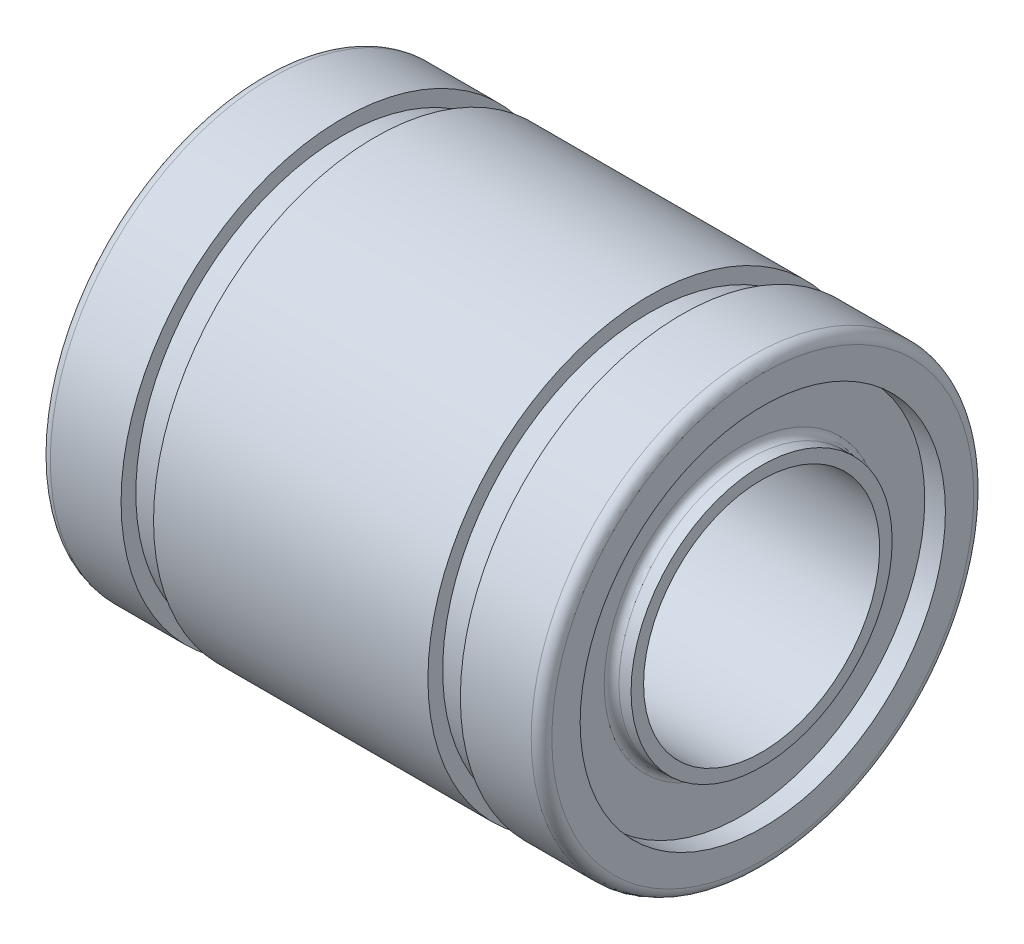
ISO-10303-21;
HEADER;
FILE_DESCRIPTION(('STEP AP214'),'2;1');
FILE_NAME('part.step','',(''),(''),'','','');
FILE_SCHEMA(('AUTOMOTIVE_DESIGN { 1 0 10303 214 1 1 1 1 }'));
ENDSEC;
DATA;
#1=APPLICATION_CONTEXT('core data for automotive mechanical design processes');
#2=APPLICATION_PROTOCOL_DEFINITION('international standard','automotive_design',2000,#1);
#3=PRODUCT_CONTEXT('',#1,'mechanical');
#4=PRODUCT('Part','Part','',(#3));
#5=PRODUCT_RELATED_PRODUCT_CATEGORY('part','',(#4));
#6=PRODUCT_DEFINITION_FORMATION('','',#4);
#7=PRODUCT_DEFINITION_CONTEXT('part definition',#1,'design');
#8=PRODUCT_DEFINITION('design','',#6,#7);
#9=PRODUCT_DEFINITION_SHAPE('','',#8);
#10=(LENGTH_UNIT() NAMED_UNIT(*) SI_UNIT(.MILLI.,.METRE.));
#11=(NAMED_UNIT(*) PLANE_ANGLE_UNIT() SI_UNIT($,.RADIAN.));
#12=(NAMED_UNIT(*) SI_UNIT($,.STERADIAN.) SOLID_ANGLE_UNIT());
#13=UNCERTAINTY_MEASURE_WITH_UNIT(LENGTH_MEASURE(1.E-05),#10,'distance_accuracy_value','');
#14=(GEOMETRIC_REPRESENTATION_CONTEXT(3) GLOBAL_UNCERTAINTY_ASSIGNED_CONTEXT((#13)) GLOBAL_UNIT_ASSIGNED_CONTEXT((#10,
#11,#12)) REPRESENTATION_CONTEXT('',''));
#15=CARTESIAN_POINT('',(0.,0.,0.));
#16=DIRECTION('',(0.,0.,1.));
#17=DIRECTION('',(1.,0.,0.));
#18=AXIS2_PLACEMENT_3D('',#15,#16,#17);
#19=CARTESIAN_POINT('',(0.,0.,0.));
#20=DIRECTION('',(-1.,0.,0.));
#21=DIRECTION('',(0.,0.,1.));
#22=AXIS2_PLACEMENT_3D('',#19,#20,#21);
#23=CYLINDRICAL_SURFACE('',#22,4.);
#24=CARTESIAN_POINT('',(8.46,0.,0.));
#25=DIRECTION('',(-1.,0.,0.));
#26=DIRECTION('',(0.,0.,1.));
#27=AXIS2_PLACEMENT_3D('',#24,#25,#26);
#28=CIRCLE('',#27,4.);
#29=CARTESIAN_POINT('',(8.46,0.,4.));
#30=VERTEX_POINT('',#29);
#31=EDGE_CURVE('E269',#30,#30,#28,.T.);
#32=ORIENTED_EDGE('',*,*,#31,.F.);
#33=EDGE_LOOP('',(#32));
#34=FACE_BOUND('',#33,.T.);
#35=CARTESIAN_POINT('',(-8.46,0.,0.));
#36=DIRECTION('',(-1.,0.,0.));
#37=DIRECTION('',(0.,0.,1.));
#38=AXIS2_PLACEMENT_3D('',#35,#36,#37);
#39=CIRCLE('',#38,4.);
#40=CARTESIAN_POINT('',(-8.46,0.,4.));
#41=VERTEX_POINT('',#40);
#42=EDGE_CURVE('E20',#41,#41,#39,.F.);
#43=ORIENTED_EDGE('',*,*,#42,.F.);
#44=EDGE_LOOP('',(#43));
#45=FACE_BOUND('',#44,.T.);
#46=ADVANCED_FACE('F17',(#34,#45),#23,.F.);
#47=CARTESIAN_POINT('',(-8.46,0.,4.));
#48=DIRECTION('',(-1.,0.,0.));
#49=DIRECTION('',(0.,0.,1.));
#50=AXIS2_PLACEMENT_3D('',#47,#48,#49);
#51=PLANE('',#50);
#52=ORIENTED_EDGE('',*,*,#42,.T.);
#53=EDGE_LOOP('',(#52));
#54=FACE_BOUND('',#53,.T.);
#55=CARTESIAN_POINT('',(-8.46,0.,0.));
#56=DIRECTION('',(-1.,0.,0.));
#57=DIRECTION('',(0.,0.,1.));
#58=AXIS2_PLACEMENT_3D('',#55,#56,#57);
#59=CIRCLE('',#58,4.425);
#60=CARTESIAN_POINT('',(-8.46,0.,4.425));
#61=VERTEX_POINT('',#60);
#62=EDGE_CURVE('E267',#61,#61,#59,.F.);
#63=ORIENTED_EDGE('',*,*,#62,.F.);
#64=EDGE_LOOP('',(#63));
#65=FACE_BOUND('',#64,.T.);
#66=ADVANCED_FACE('F276',(#54,#65),#51,.T.);
#67=CARTESIAN_POINT('',(8.46,0.,4.425));
#68=DIRECTION('',(1.,0.,0.));
#69=DIRECTION('',(0.,0.,-1.));
#70=AXIS2_PLACEMENT_3D('',#67,#68,#69);
#71=PLANE('',#70);
#72=ORIENTED_EDGE('',*,*,#31,.T.);
#73=EDGE_LOOP('',(#72));
#74=FACE_BOUND('',#73,.T.);
#75=CARTESIAN_POINT('',(8.46,0.,0.));
#76=DIRECTION('',(-1.,0.,0.));
#77=DIRECTION('',(0.,0.,1.));
#78=AXIS2_PLACEMENT_3D('',#75,#76,#77);
#79=CIRCLE('',#78,4.425);
#80=CARTESIAN_POINT('',(8.46,0.,4.425));
#81=VERTEX_POINT('',#80);
#82=EDGE_CURVE('E263',#81,#81,#79,.T.);
#83=ORIENTED_EDGE('',*,*,#82,.F.);
#84=EDGE_LOOP('',(#83));
#85=FACE_BOUND('',#84,.T.);
#86=ADVANCED_FACE('F285',(#74,#85),#71,.T.);
#87=CARTESIAN_POINT('',(-8.13,0.,0.));
#88=DIRECTION('',(-1.,0.,0.));
#89=DIRECTION('',(0.,0.,1.));
#90=AXIS2_PLACEMENT_3D('',#87,#88,#89);
#91=CYLINDRICAL_SURFACE('',#90,4.425);
#92=CARTESIAN_POINT('',(-8.05,0.,0.));
#93=DIRECTION('',(-1.,0.,0.));
#94=DIRECTION('',(0.,0.,1.));
#95=AXIS2_PLACEMENT_3D('',#92,#93,#94);
#96=CIRCLE('',#95,4.425);
#97=CARTESIAN_POINT('',(-8.05,0.,4.425));
#98=VERTEX_POINT('',#97);
#99=EDGE_CURVE('E266',#98,#98,#96,.T.);
#100=ORIENTED_EDGE('',*,*,#99,.T.);
#101=EDGE_LOOP('',(#100));
#102=FACE_BOUND('',#101,.T.);
#103=ORIENTED_EDGE('',*,*,#62,.T.);
#104=EDGE_LOOP('',(#103));
#105=FACE_BOUND('',#104,.T.);
#106=ADVANCED_FACE('F435',(#102,#105),#91,.T.);
#107=CARTESIAN_POINT('',(8.13,0.,0.));
#108=DIRECTION('',(-1.,0.,0.));
#109=DIRECTION('',(0.,0.,1.));
#110=AXIS2_PLACEMENT_3D('',#107,#108,#109);
#111=CYLINDRICAL_SURFACE('',#110,4.425);
#112=ORIENTED_EDGE('',*,*,#82,.T.);
#113=EDGE_LOOP('',(#112));
#114=FACE_BOUND('',#113,.T.);
#115=CARTESIAN_POINT('',(8.05,0.,0.));
#116=DIRECTION('',(-1.,0.,0.));
#117=DIRECTION('',(0.,0.,1.));
#118=AXIS2_PLACEMENT_3D('',#115,#116,#117);
#119=CIRCLE('',#118,4.425);
#120=CARTESIAN_POINT('',(8.05,0.,4.425));
#121=VERTEX_POINT('',#120);
#122=EDGE_CURVE('E63',#121,#121,#119,.F.);
#123=ORIENTED_EDGE('',*,*,#122,.T.);
#124=EDGE_LOOP('',(#123));
#125=FACE_BOUND('',#124,.T.);
#126=ADVANCED_FACE('F428',(#114,#125),#111,.T.);
#127=CARTESIAN_POINT('',(-8.05,0.,0.));
#128=DIRECTION('',(-1.,0.,0.));
#129=DIRECTION('',(0.,0.,1.));
#130=AXIS2_PLACEMENT_3D('',#127,#128,#129);
#131=TOROIDAL_SURFACE('',#130,4.675,0.25);
#132=ORIENTED_EDGE('',*,*,#99,.F.);
#133=EDGE_LOOP('',(#132));
#134=FACE_BOUND('',#133,.T.);
#135=CARTESIAN_POINT('',(-7.8,0.,0.));
#136=DIRECTION('',(-1.,0.,0.));
#137=DIRECTION('',(0.,0.,1.));
#138=AXIS2_PLACEMENT_3D('',#135,#136,#137);
#139=CIRCLE('',#138,4.675);
#140=CARTESIAN_POINT('',(-7.8,0.,-4.675));
#141=VERTEX_POINT('',#140);
#142=CARTESIAN_POINT('',(-7.8,0.,4.675));
#143=VERTEX_POINT('',#142);
#144=EDGE_CURVE('E58',#141,#143,#139,.F.);
#145=ORIENTED_EDGE('',*,*,#144,.F.);
#146=CARTESIAN_POINT('',(-7.8,0.,0.));
#147=DIRECTION('',(-1.,0.,0.));
#148=DIRECTION('',(0.,0.,-1.));
#149=AXIS2_PLACEMENT_3D('',#146,#147,#148);
#150=CIRCLE('',#149,4.675);
#151=EDGE_CURVE('E55',#143,#141,#150,.F.);
#152=ORIENTED_EDGE('',*,*,#151,.F.);
#153=EDGE_LOOP('',(#145,#152));
#154=FACE_BOUND('',#153,.T.);
#155=ADVANCED_FACE('F60',(#134,#154),#131,.F.);
#156=CARTESIAN_POINT('',(8.05,0.,0.));
#157=DIRECTION('',(-1.,0.,0.));
#158=DIRECTION('',(0.,0.,1.));
#159=AXIS2_PLACEMENT_3D('',#156,#157,#158);
#160=TOROIDAL_SURFACE('',#159,4.675,0.25);
#161=CARTESIAN_POINT('',(7.8,0.,0.));
#162=DIRECTION('',(1.,0.,0.));
#163=DIRECTION('',(0.,0.,1.));
#164=AXIS2_PLACEMENT_3D('',#161,#162,#163);
#165=CIRCLE('',#164,4.675);
#166=CARTESIAN_POINT('',(7.8,0.,-4.675));
#167=VERTEX_POINT('',#166);
#168=CARTESIAN_POINT('',(7.8,0.,4.675));
#169=VERTEX_POINT('',#168);
#170=EDGE_CURVE('E69',#167,#169,#165,.F.);
#171=ORIENTED_EDGE('',*,*,#170,.F.);
#172=CARTESIAN_POINT('',(7.8,0.,0.));
#173=DIRECTION('',(1.,0.,0.));
#174=DIRECTION('',(0.,0.,-1.));
#175=AXIS2_PLACEMENT_3D('',#172,#173,#174);
#176=CIRCLE('',#175,4.675);
#177=EDGE_CURVE('E119',#169,#167,#176,.F.);
#178=ORIENTED_EDGE('',*,*,#177,.F.);
#179=EDGE_LOOP('',(#171,#178));
#180=FACE_BOUND('',#179,.T.);
#181=ORIENTED_EDGE('',*,*,#122,.F.);
#182=EDGE_LOOP('',(#181));
#183=FACE_BOUND('',#182,.T.);
#184=ADVANCED_FACE('F90',(#180,#183),#160,.F.);
#185=CARTESIAN_POINT('',(-7.8,0.,4.425));
#186=DIRECTION('',(-1.,0.,0.));
#187=DIRECTION('',(0.,0.,1.));
#188=AXIS2_PLACEMENT_3D('',#185,#186,#187);
#189=PLANE('',#188);
#190=ORIENTED_EDGE('',*,*,#144,.T.);
#191=ORIENTED_EDGE('',*,*,#151,.T.);
#192=EDGE_LOOP('',(#190,#191));
#193=FACE_BOUND('',#192,.T.);
#194=CARTESIAN_POINT('',(-7.8,0.,0.));
#195=DIRECTION('',(-1.,0.,0.));
#196=DIRECTION('',(0.,0.,1.));
#197=AXIS2_PLACEMENT_3D('',#194,#195,#196);
#198=CIRCLE('',#197,6.19);
#199=CARTESIAN_POINT('',(-7.8,0.,6.19));
#200=VERTEX_POINT('',#199);
#201=EDGE_CURVE('E124',#200,#200,#198,.T.);
#202=ORIENTED_EDGE('',*,*,#201,.T.);
#203=EDGE_LOOP('',(#202));
#204=FACE_BOUND('',#203,.T.);
#205=ADVANCED_FACE('F67',(#193,#204),#189,.T.);
#206=CARTESIAN_POINT('',(7.8,0.,6.19));
#207=DIRECTION('',(1.,0.,0.));
#208=DIRECTION('',(0.,0.,-1.));
#209=AXIS2_PLACEMENT_3D('',#206,#207,#208);
#210=PLANE('',#209);
#211=ORIENTED_EDGE('',*,*,#170,.T.);
#212=ORIENTED_EDGE('',*,*,#177,.T.);
#213=EDGE_LOOP('',(#211,#212));
#214=FACE_BOUND('',#213,.T.);
#215=CARTESIAN_POINT('',(7.8,0.,0.));
#216=DIRECTION('',(-1.,0.,0.));
#217=DIRECTION('',(0.,0.,1.));
#218=AXIS2_PLACEMENT_3D('',#215,#216,#217);
#219=CIRCLE('',#218,6.19);
#220=CARTESIAN_POINT('',(7.8,0.,6.19));
#221=VERTEX_POINT('',#220);
#222=EDGE_CURVE('E253',#221,#221,#219,.F.);
#223=ORIENTED_EDGE('',*,*,#222,.T.);
#224=EDGE_LOOP('',(#223));
#225=FACE_BOUND('',#224,.T.);
#226=ADVANCED_FACE('F89',(#214,#225),#210,.T.);
#227=CARTESIAN_POINT('',(-8.15,0.,0.));
#228=DIRECTION('',(-1.,0.,0.));
#229=DIRECTION('',(0.,0.,1.));
#230=AXIS2_PLACEMENT_3D('',#227,#228,#229);
#231=CYLINDRICAL_SURFACE('',#230,6.19);
#232=ORIENTED_EDGE('',*,*,#201,.F.);
#233=EDGE_LOOP('',(#232));
#234=FACE_BOUND('',#233,.T.);
#235=CARTESIAN_POINT('',(-8.5,0.,0.));
#236=DIRECTION('',(-1.,0.,0.));
#237=DIRECTION('',(0.,0.,1.));
#238=AXIS2_PLACEMENT_3D('',#235,#236,#237);
#239=CIRCLE('',#238,6.19);
#240=CARTESIAN_POINT('',(-8.5,0.,6.19));
#241=VERTEX_POINT('',#240);
#242=EDGE_CURVE('E248',#241,#241,#239,.F.);
#243=ORIENTED_EDGE('',*,*,#242,.F.);
#244=EDGE_LOOP('',(#243));
#245=FACE_BOUND('',#244,.T.);
#246=ADVANCED_FACE('F402',(#234,#245),#231,.F.);
#247=CARTESIAN_POINT('',(8.15,0.,0.));
#248=DIRECTION('',(-1.,0.,0.));
#249=DIRECTION('',(0.,0.,1.));
#250=AXIS2_PLACEMENT_3D('',#247,#248,#249);
#251=CYLINDRICAL_SURFACE('',#250,6.19);
#252=CARTESIAN_POINT('',(8.5,0.,0.));
#253=DIRECTION('',(-1.,0.,0.));
#254=DIRECTION('',(0.,0.,1.));
#255=AXIS2_PLACEMENT_3D('',#252,#253,#254);
#256=CIRCLE('',#255,6.19);
#257=CARTESIAN_POINT('',(8.5,0.,6.19));
#258=VERTEX_POINT('',#257);
#259=EDGE_CURVE('E246',#258,#258,#256,.T.);
#260=ORIENTED_EDGE('',*,*,#259,.F.);
#261=EDGE_LOOP('',(#260));
#262=FACE_BOUND('',#261,.T.);
#263=ORIENTED_EDGE('',*,*,#222,.F.);
#264=EDGE_LOOP('',(#263));
#265=FACE_BOUND('',#264,.T.);
#266=ADVANCED_FACE('F226',(#262,#265),#251,.F.);
#267=CARTESIAN_POINT('',(-8.5,0.,6.19));
#268=DIRECTION('',(-1.,0.,0.));
#269=DIRECTION('',(0.,0.,1.));
#270=AXIS2_PLACEMENT_3D('',#267,#268,#269);
#271=PLANE('',#270);
#272=ORIENTED_EDGE('',*,*,#242,.T.);
#273=EDGE_LOOP('',(#272));
#274=FACE_BOUND('',#273,.T.);
#275=CARTESIAN_POINT('',(-8.5,0.,0.));
#276=DIRECTION('',(1.,0.,0.));
#277=DIRECTION('',(0.,0.,1.));
#278=AXIS2_PLACEMENT_3D('',#275,#276,#277);
#279=CIRCLE('',#278,7.15);
#280=CARTESIAN_POINT('',(-8.5,0.,7.15));
#281=VERTEX_POINT('',#280);
#282=CARTESIAN_POINT('',(-8.5,0.,-7.15));
#283=VERTEX_POINT('',#282);
#284=EDGE_CURVE('E212',#281,#283,#279,.T.);
#285=ORIENTED_EDGE('',*,*,#284,.F.);
#286=CARTESIAN_POINT('',(-8.5,0.,0.));
#287=DIRECTION('',(1.,0.,0.));
#288=DIRECTION('',(0.,0.,-1.));
#289=AXIS2_PLACEMENT_3D('',#286,#287,#288);
#290=CIRCLE('',#289,7.15);
#291=EDGE_CURVE('E245',#283,#281,#290,.T.);
#292=ORIENTED_EDGE('',*,*,#291,.F.);
#293=EDGE_LOOP('',(#285,#292));
#294=FACE_BOUND('',#293,.T.);
#295=ADVANCED_FACE('F217',(#274,#294),#271,.T.);
#296=CARTESIAN_POINT('',(8.5,0.,7.5));
#297=DIRECTION('',(1.,0.,0.));
#298=DIRECTION('',(0.,0.,-1.));
#299=AXIS2_PLACEMENT_3D('',#296,#297,#298);
#300=PLANE('',#299);
#301=ORIENTED_EDGE('',*,*,#259,.T.);
#302=EDGE_LOOP('',(#301));
#303=FACE_BOUND('',#302,.T.);
#304=CARTESIAN_POINT('',(8.5,0.,0.));
#305=DIRECTION('',(-1.,0.,0.));
#306=DIRECTION('',(0.,0.,1.));
#307=AXIS2_PLACEMENT_3D('',#304,#305,#306);
#308=CIRCLE('',#307,7.15);
#309=CARTESIAN_POINT('',(8.5,0.,7.15));
#310=VERTEX_POINT('',#309);
#311=CARTESIAN_POINT('',(8.5,0.,-7.15));
#312=VERTEX_POINT('',#311);
#313=EDGE_CURVE('E34',#310,#312,#308,.T.);
#314=ORIENTED_EDGE('',*,*,#313,.F.);
#315=CARTESIAN_POINT('',(8.5,0.,0.));
#316=DIRECTION('',(-1.,0.,0.));
#317=DIRECTION('',(0.,0.,-1.));
#318=AXIS2_PLACEMENT_3D('',#315,#316,#317);
#319=CIRCLE('',#318,7.15);
#320=EDGE_CURVE('E181',#312,#310,#319,.T.);
#321=ORIENTED_EDGE('',*,*,#320,.F.);
#322=EDGE_LOOP('',(#314,#321));
#323=FACE_BOUND('',#322,.T.);
#324=ADVANCED_FACE('F160',(#303,#323),#300,.T.);
#325=CARTESIAN_POINT('',(-8.15,0.,0.));
#326=DIRECTION('',(-1.,0.,0.));
#327=DIRECTION('',(0.,0.,1.));
#328=AXIS2_PLACEMENT_3D('',#325,#326,#327);
#329=TOROIDAL_SURFACE('',#328,7.15,0.35);
#330=CARTESIAN_POINT('',(-8.15,0.,0.));
#331=DIRECTION('',(-1.,0.,0.));
#332=DIRECTION('',(0.,0.,1.));
#333=AXIS2_PLACEMENT_3D('',#330,#331,#332);
#334=CIRCLE('',#333,7.5);
#335=CARTESIAN_POINT('',(-8.15,0.,7.5));
#336=VERTEX_POINT('',#335);
#337=EDGE_CURVE('E332',#336,#336,#334,.F.);
#338=ORIENTED_EDGE('',*,*,#337,.F.);
#339=EDGE_LOOP('',(#338));
#340=FACE_BOUND('',#339,.T.);
#341=ORIENTED_EDGE('',*,*,#284,.T.);
#342=ORIENTED_EDGE('',*,*,#291,.T.);
#343=EDGE_LOOP('',(#341,#342));
#344=FACE_BOUND('',#343,.T.);
#345=ADVANCED_FACE('F148',(#340,#344),#329,.T.);
#346=CARTESIAN_POINT('',(8.15,0.,0.));
#347=DIRECTION('',(-1.,0.,0.));
#348=DIRECTION('',(0.,0.,1.));
#349=AXIS2_PLACEMENT_3D('',#346,#347,#348);
#350=TOROIDAL_SURFACE('',#349,7.15,0.35);
#351=ORIENTED_EDGE('',*,*,#313,.T.);
#352=ORIENTED_EDGE('',*,*,#320,.T.);
#353=EDGE_LOOP('',(#351,#352));
#354=FACE_BOUND('',#353,.T.);
#355=CARTESIAN_POINT('',(8.15,0.,0.));
#356=DIRECTION('',(-1.,0.,0.));
#357=DIRECTION('',(0.,0.,1.));
#358=AXIS2_PLACEMENT_3D('',#355,#356,#357);
#359=CIRCLE('',#358,7.5);
#360=CARTESIAN_POINT('',(8.15,0.,7.5));
#361=VERTEX_POINT('',#360);
#362=EDGE_CURVE('E333',#361,#361,#359,.T.);
#363=ORIENTED_EDGE('',*,*,#362,.F.);
#364=EDGE_LOOP('',(#363));
#365=FACE_BOUND('',#364,.T.);
#366=ADVANCED_FACE('F159',(#354,#365),#350,.T.);
#367=CARTESIAN_POINT('',(0.,0.,0.));
#368=DIRECTION('',(-1.,0.,0.));
#369=DIRECTION('',(0.,0.,1.));
#370=AXIS2_PLACEMENT_3D('',#367,#368,#369);
#371=CYLINDRICAL_SURFACE('',#370,7.5);
#372=CARTESIAN_POINT('',(-5.75,0.,0.));
#373=DIRECTION('',(-1.,0.,0.));
#374=DIRECTION('',(0.,0.,1.));
#375=AXIS2_PLACEMENT_3D('',#372,#373,#374);
#376=CIRCLE('',#375,7.5);
#377=CARTESIAN_POINT('',(-5.75,0.,7.5));
#378=VERTEX_POINT('',#377);
#379=EDGE_CURVE('E256',#378,#378,#376,.T.);
#380=ORIENTED_EDGE('',*,*,#379,.T.);
#381=EDGE_LOOP('',(#380));
#382=FACE_BOUND('',#381,.T.);
#383=ORIENTED_EDGE('',*,*,#337,.T.);
#384=EDGE_LOOP('',(#383));
#385=FACE_BOUND('',#384,.T.);
#386=ADVANCED_FACE('F320',(#382,#385),#371,.T.);
#387=CARTESIAN_POINT('',(0.,0.,0.));
#388=DIRECTION('',(-1.,0.,0.));
#389=DIRECTION('',(0.,0.,1.));
#390=AXIS2_PLACEMENT_3D('',#387,#388,#389);
#391=CYLINDRICAL_SURFACE('',#390,7.5);
#392=ORIENTED_EDGE('',*,*,#362,.T.);
#393=EDGE_LOOP('',(#392));
#394=FACE_BOUND('',#393,.T.);
#395=CARTESIAN_POINT('',(5.75,0.,0.));
#396=DIRECTION('',(-1.,0.,0.));
#397=DIRECTION('',(0.,0.,1.));
#398=AXIS2_PLACEMENT_3D('',#395,#396,#397);
#399=CIRCLE('',#398,7.5);
#400=CARTESIAN_POINT('',(5.75,0.,7.5));
#401=VERTEX_POINT('',#400);
#402=EDGE_CURVE('E341',#401,#401,#399,.F.);
#403=ORIENTED_EDGE('',*,*,#402,.T.);
#404=EDGE_LOOP('',(#403));
#405=FACE_BOUND('',#404,.T.);
#406=ADVANCED_FACE('F317',(#394,#405),#391,.T.);
#407=CARTESIAN_POINT('',(-5.75,0.,7.));
#408=DIRECTION('',(-1.,0.,0.));
#409=DIRECTION('',(0.,-1.,0.));
#410=AXIS2_PLACEMENT_3D('',#407,#408,#409);
#411=PLANE('',#410);
#412=CARTESIAN_POINT('',(-5.75,0.,0.));
#413=DIRECTION('',(-1.,0.,0.));
#414=DIRECTION('',(0.,-1.,0.));
#415=AXIS2_PLACEMENT_3D('',#412,#413,#414);
#416=CIRCLE('',#415,7.);
#417=CARTESIAN_POINT('',(-5.75,-7.,0.));
#418=VERTEX_POINT('',#417);
#419=EDGE_CURVE('E343',#418,#418,#416,.F.);
#420=ORIENTED_EDGE('',*,*,#419,.F.);
#421=EDGE_LOOP('',(#420));
#422=FACE_BOUND('',#421,.T.);
#423=ORIENTED_EDGE('',*,*,#379,.F.);
#424=EDGE_LOOP('',(#423));
#425=FACE_BOUND('',#424,.T.);
#426=ADVANCED_FACE('F313',(#422,#425),#411,.F.);
#427=CARTESIAN_POINT('',(5.75,0.,7.5));
#428=DIRECTION('',(1.,0.,0.));
#429=DIRECTION('',(0.,1.,0.));
#430=AXIS2_PLACEMENT_3D('',#427,#428,#429);
#431=PLANE('',#430);
#432=CARTESIAN_POINT('',(5.75,0.,0.));
#433=DIRECTION('',(-1.,0.,0.));
#434=DIRECTION('',(0.,-1.,0.));
#435=AXIS2_PLACEMENT_3D('',#432,#433,#434);
#436=CIRCLE('',#435,7.);
#437=CARTESIAN_POINT('',(5.75,-7.,0.));
#438=VERTEX_POINT('',#437);
#439=EDGE_CURVE('E347',#438,#438,#436,.T.);
#440=ORIENTED_EDGE('',*,*,#439,.F.);
#441=EDGE_LOOP('',(#440));
#442=FACE_BOUND('',#441,.T.);
#443=ORIENTED_EDGE('',*,*,#402,.F.);
#444=EDGE_LOOP('',(#443));
#445=FACE_BOUND('',#444,.T.);
#446=ADVANCED_FACE('F309',(#442,#445),#431,.F.);
#447=CARTESIAN_POINT('',(-5.2,0.,0.));
#448=DIRECTION('',(-1.,0.,0.));
#449=DIRECTION('',(0.,-1.,0.));
#450=AXIS2_PLACEMENT_3D('',#447,#448,#449);
#451=CYLINDRICAL_SURFACE('',#450,7.);
#452=ORIENTED_EDGE('',*,*,#419,.T.);
#453=EDGE_LOOP('',(#452));
#454=FACE_BOUND('',#453,.T.);
#455=CARTESIAN_POINT('',(-4.65,0.,0.));
#456=DIRECTION('',(-1.,0.,0.));
#457=DIRECTION('',(0.,-1.,0.));
#458=AXIS2_PLACEMENT_3D('',#455,#456,#457);
#459=CIRCLE('',#458,7.);
#460=CARTESIAN_POINT('',(-4.65,-7.,0.));
#461=VERTEX_POINT('',#460);
#462=EDGE_CURVE('E352',#461,#461,#459,.T.);
#463=ORIENTED_EDGE('',*,*,#462,.T.);
#464=EDGE_LOOP('',(#463));
#465=FACE_BOUND('',#464,.T.);
#466=ADVANCED_FACE('F305',(#454,#465),#451,.T.);
#467=CARTESIAN_POINT('',(5.2,0.,0.));
#468=DIRECTION('',(-1.,0.,0.));
#469=DIRECTION('',(0.,-1.,0.));
#470=AXIS2_PLACEMENT_3D('',#467,#468,#469);
#471=CYLINDRICAL_SURFACE('',#470,7.);
#472=CARTESIAN_POINT('',(4.65,0.,0.));
#473=DIRECTION('',(-1.,0.,0.));
#474=DIRECTION('',(0.,-1.,0.));
#475=AXIS2_PLACEMENT_3D('',#472,#473,#474);
#476=CIRCLE('',#475,7.);
#477=CARTESIAN_POINT('',(4.65,-7.,0.));
#478=VERTEX_POINT('',#477);
#479=EDGE_CURVE('E355',#478,#478,#476,.F.);
#480=ORIENTED_EDGE('',*,*,#479,.T.);
#481=EDGE_LOOP('',(#480));
#482=FACE_BOUND('',#481,.T.);
#483=ORIENTED_EDGE('',*,*,#439,.T.);
#484=EDGE_LOOP('',(#483));
#485=FACE_BOUND('',#484,.T.);
#486=ADVANCED_FACE('F301',(#482,#485),#471,.T.);
#487=CARTESIAN_POINT('',(-4.65,0.,7.5));
#488=DIRECTION('',(1.,0.,0.));
#489=DIRECTION('',(0.,1.,0.));
#490=AXIS2_PLACEMENT_3D('',#487,#488,#489);
#491=PLANE('',#490);
#492=ORIENTED_EDGE('',*,*,#462,.F.);
#493=EDGE_LOOP('',(#492));
#494=FACE_BOUND('',#493,.T.);
#495=CARTESIAN_POINT('',(-4.65,0.,0.));
#496=DIRECTION('',(-1.,0.,0.));
#497=DIRECTION('',(0.,0.,1.));
#498=AXIS2_PLACEMENT_3D('',#495,#496,#497);
#499=CIRCLE('',#498,7.5);
#500=CARTESIAN_POINT('',(-4.65,0.,7.5));
#501=VERTEX_POINT('',#500);
#502=EDGE_CURVE('E26',#501,#501,#499,.F.);
#503=ORIENTED_EDGE('',*,*,#502,.F.);
#504=EDGE_LOOP('',(#503));
#505=FACE_BOUND('',#504,.T.);
#506=ADVANCED_FACE('F294',(#494,#505),#491,.F.);
#507=CARTESIAN_POINT('',(4.65,0.,7.));
#508=DIRECTION('',(-1.,0.,0.));
#509=DIRECTION('',(0.,-1.,0.));
#510=AXIS2_PLACEMENT_3D('',#507,#508,#509);
#511=PLANE('',#510);
#512=ORIENTED_EDGE('',*,*,#479,.F.);
#513=EDGE_LOOP('',(#512));
#514=FACE_BOUND('',#513,.T.);
#515=CARTESIAN_POINT('',(4.65,0.,0.));
#516=DIRECTION('',(-1.,0.,0.));
#517=DIRECTION('',(0.,0.,1.));
#518=AXIS2_PLACEMENT_3D('',#515,#516,#517);
#519=CIRCLE('',#518,7.5);
#520=CARTESIAN_POINT('',(4.65,0.,7.5));
#521=VERTEX_POINT('',#520);
#522=EDGE_CURVE('E11',#521,#521,#519,.T.);
#523=ORIENTED_EDGE('',*,*,#522,.F.);
#524=EDGE_LOOP('',(#523));
#525=FACE_BOUND('',#524,.T.);
#526=ADVANCED_FACE('F288',(#514,#525),#511,.F.);
#527=CARTESIAN_POINT('',(0.,0.,0.));
#528=DIRECTION('',(-1.,0.,0.));
#529=DIRECTION('',(0.,0.,1.));
#530=AXIS2_PLACEMENT_3D('',#527,#528,#529);
#531=CYLINDRICAL_SURFACE('',#530,7.5);
#532=ORIENTED_EDGE('',*,*,#522,.T.);
#533=EDGE_LOOP('',(#532));
#534=FACE_BOUND('',#533,.T.);
#535=ORIENTED_EDGE('',*,*,#502,.T.);
#536=EDGE_LOOP('',(#535));
#537=FACE_BOUND('',#536,.T.);
#538=ADVANCED_FACE('F286',(#534,#537),#531,.T.);
#539=CLOSED_SHELL('',(#46,#66,#86,#106,#126,#155,#184,#205,#226,#246,#266,#295,#324,#345,#366,
#386,#406,#426,#446,#466,#486,#506,#526,#538));
#540=MANIFOLD_SOLID_BREP('B1',#539);
#541=ADVANCED_BREP_SHAPE_REPRESENTATION('',(#18,#540),#14);
#542=SHAPE_DEFINITION_REPRESENTATION(#9,#541);
ENDSEC;
END-ISO-10303-21;
